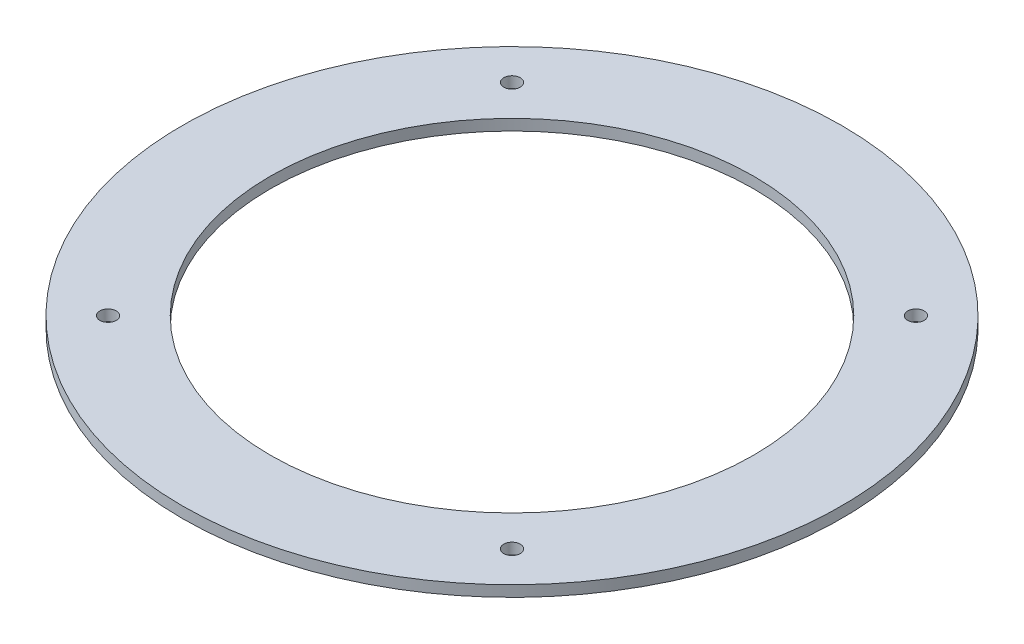
ISO-10303-21;
HEADER;
FILE_DESCRIPTION(('STEP AP214'),'2;1');
FILE_NAME('part.step','',(''),(''),'','','');
FILE_SCHEMA(('AUTOMOTIVE_DESIGN { 1 0 10303 214 1 1 1 1 }'));
ENDSEC;
DATA;
#1=APPLICATION_CONTEXT('core data for automotive mechanical design processes');
#2=APPLICATION_PROTOCOL_DEFINITION('international standard','automotive_design',2000,#1);
#3=PRODUCT_CONTEXT('',#1,'mechanical');
#4=PRODUCT('Part','Part','',(#3));
#5=PRODUCT_RELATED_PRODUCT_CATEGORY('part','',(#4));
#6=PRODUCT_DEFINITION_FORMATION('','',#4);
#7=PRODUCT_DEFINITION_CONTEXT('part definition',#1,'design');
#8=PRODUCT_DEFINITION('design','',#6,#7);
#9=PRODUCT_DEFINITION_SHAPE('','',#8);
#10=(LENGTH_UNIT() NAMED_UNIT(*) SI_UNIT(.MILLI.,.METRE.));
#11=(NAMED_UNIT(*) PLANE_ANGLE_UNIT() SI_UNIT($,.RADIAN.));
#12=(NAMED_UNIT(*) SI_UNIT($,.STERADIAN.) SOLID_ANGLE_UNIT());
#13=UNCERTAINTY_MEASURE_WITH_UNIT(LENGTH_MEASURE(1.E-05),#10,'distance_accuracy_value','');
#14=(GEOMETRIC_REPRESENTATION_CONTEXT(3) GLOBAL_UNCERTAINTY_ASSIGNED_CONTEXT((#13)) GLOBAL_UNIT_ASSIGNED_CONTEXT((#10,
#11,#12)) REPRESENTATION_CONTEXT('',''));
#15=CARTESIAN_POINT('',(0.,0.,0.));
#16=DIRECTION('',(0.,0.,1.));
#17=DIRECTION('',(1.,0.,0.));
#18=AXIS2_PLACEMENT_3D('',#15,#16,#17);
#19=CARTESIAN_POINT('',(0.,-2.,0.));
#20=DIRECTION('',(0.,1.,0.));
#21=DIRECTION('',(0.,0.,1.));
#22=AXIS2_PLACEMENT_3D('',#19,#20,#21);
#23=CYLINDRICAL_SURFACE('',#22,60.);
#24=CARTESIAN_POINT('',(0.,-2.,0.));
#25=DIRECTION('',(0.,1.,0.));
#26=DIRECTION('',(0.,0.,1.));
#27=AXIS2_PLACEMENT_3D('',#24,#25,#26);
#28=CIRCLE('',#27,60.);
#29=CARTESIAN_POINT('',(0.,-2.,60.));
#30=VERTEX_POINT('',#29);
#31=EDGE_CURVE('E10',#30,#30,#28,.T.);
#32=ORIENTED_EDGE('',*,*,#31,.T.);
#33=EDGE_LOOP('',(#32));
#34=FACE_BOUND('',#33,.T.);
#35=CARTESIAN_POINT('',(0.,0.,0.));
#36=DIRECTION('',(0.,1.,0.));
#37=DIRECTION('',(0.,0.,1.));
#38=AXIS2_PLACEMENT_3D('',#35,#36,#37);
#39=CIRCLE('',#38,60.);
#40=CARTESIAN_POINT('',(0.,0.,60.));
#41=VERTEX_POINT('',#40);
#42=EDGE_CURVE('E40',#41,#41,#39,.T.);
#43=ORIENTED_EDGE('',*,*,#42,.F.);
#44=EDGE_LOOP('',(#43));
#45=FACE_BOUND('',#44,.T.);
#46=ADVANCED_FACE('F37',(#34,#45),#23,.T.);
#47=CARTESIAN_POINT('',(0.,-2.,0.));
#48=DIRECTION('',(0.,1.,0.));
#49=DIRECTION('',(0.,0.,1.));
#50=AXIS2_PLACEMENT_3D('',#47,#48,#49);
#51=PLANE('',#50);
#52=CARTESIAN_POINT('',(36.7695526217005,-2.,-36.7695526217005));
#53=DIRECTION('',(0.,1.,0.));
#54=DIRECTION('',(0.,0.,1.));
#55=AXIS2_PLACEMENT_3D('',#52,#53,#54);
#56=CIRCLE('',#55,1.5);
#57=CARTESIAN_POINT('',(36.7695526217005,-2.,-35.2695526217005));
#58=VERTEX_POINT('',#57);
#59=EDGE_CURVE('E60',#58,#58,#56,.F.);
#60=ORIENTED_EDGE('',*,*,#59,.F.);
#61=EDGE_LOOP('',(#60));
#62=FACE_BOUND('',#61,.T.);
#63=CARTESIAN_POINT('',(-36.7695526217005,-2.,36.7695526217005));
#64=DIRECTION('',(0.,1.,0.));
#65=DIRECTION('',(0.,0.,1.));
#66=AXIS2_PLACEMENT_3D('',#63,#64,#65);
#67=CIRCLE('',#66,1.5);
#68=CARTESIAN_POINT('',(-36.7695526217005,-2.,38.2695526217005));
#69=VERTEX_POINT('',#68);
#70=EDGE_CURVE('E61',#69,#69,#67,.F.);
#71=ORIENTED_EDGE('',*,*,#70,.F.);
#72=EDGE_LOOP('',(#71));
#73=FACE_BOUND('',#72,.T.);
#74=CARTESIAN_POINT('',(36.7695526217005,-2.,36.7695526217005));
#75=DIRECTION('',(0.,1.,0.));
#76=DIRECTION('',(0.,0.,1.));
#77=AXIS2_PLACEMENT_3D('',#74,#75,#76);
#78=CIRCLE('',#77,1.5);
#79=CARTESIAN_POINT('',(36.7695526217005,-2.,38.2695526217005));
#80=VERTEX_POINT('',#79);
#81=EDGE_CURVE('E68',#80,#80,#78,.F.);
#82=ORIENTED_EDGE('',*,*,#81,.F.);
#83=EDGE_LOOP('',(#82));
#84=FACE_BOUND('',#83,.T.);
#85=CARTESIAN_POINT('',(-36.7695526217005,-2.,-36.7695526217005));
#86=DIRECTION('',(0.,1.,0.));
#87=DIRECTION('',(0.,0.,1.));
#88=AXIS2_PLACEMENT_3D('',#85,#86,#87);
#89=CIRCLE('',#88,1.5);
#90=CARTESIAN_POINT('',(-36.7695526217005,-2.,-35.2695526217005));
#91=VERTEX_POINT('',#90);
#92=EDGE_CURVE('E54',#91,#91,#89,.F.);
#93=ORIENTED_EDGE('',*,*,#92,.F.);
#94=EDGE_LOOP('',(#93));
#95=FACE_BOUND('',#94,.T.);
#96=CARTESIAN_POINT('',(0.,-2.,0.));
#97=DIRECTION('',(0.,1.,0.));
#98=DIRECTION('',(0.,0.,1.));
#99=AXIS2_PLACEMENT_3D('',#96,#97,#98);
#100=CIRCLE('',#99,44.);
#101=CARTESIAN_POINT('',(0.,-2.,44.));
#102=VERTEX_POINT('',#101);
#103=EDGE_CURVE('E47',#102,#102,#100,.F.);
#104=ORIENTED_EDGE('',*,*,#103,.F.);
#105=EDGE_LOOP('',(#104));
#106=FACE_BOUND('',#105,.T.);
#107=ORIENTED_EDGE('',*,*,#31,.F.);
#108=EDGE_LOOP('',(#107));
#109=FACE_BOUND('',#108,.T.);
#110=ADVANCED_FACE('F86',(#62,#73,#84,#95,#106,#109),#51,.F.);
#111=CARTESIAN_POINT('',(0.,0.,0.));
#112=DIRECTION('',(0.,1.,0.));
#113=DIRECTION('',(0.,0.,1.));
#114=AXIS2_PLACEMENT_3D('',#111,#112,#113);
#115=PLANE('',#114);
#116=CARTESIAN_POINT('',(36.7695526217005,0.,-36.7695526217005));
#117=DIRECTION('',(0.,1.,0.));
#118=DIRECTION('',(0.,0.,-1.));
#119=AXIS2_PLACEMENT_3D('',#116,#117,#118);
#120=CIRCLE('',#119,1.5);
#121=CARTESIAN_POINT('',(36.7695526217005,0.,-38.2695526217005));
#122=VERTEX_POINT('',#121);
#123=EDGE_CURVE('E64',#122,#122,#120,.T.);
#124=ORIENTED_EDGE('',*,*,#123,.F.);
#125=EDGE_LOOP('',(#124));
#126=FACE_BOUND('',#125,.T.);
#127=CARTESIAN_POINT('',(-36.7695526217005,0.,36.7695526217005));
#128=DIRECTION('',(0.,1.,0.));
#129=DIRECTION('',(0.,0.,-1.));
#130=AXIS2_PLACEMENT_3D('',#127,#128,#129);
#131=CIRCLE('',#130,1.5);
#132=CARTESIAN_POINT('',(-36.7695526217005,0.,35.2695526217005));
#133=VERTEX_POINT('',#132);
#134=EDGE_CURVE('E65',#133,#133,#131,.T.);
#135=ORIENTED_EDGE('',*,*,#134,.F.);
#136=EDGE_LOOP('',(#135));
#137=FACE_BOUND('',#136,.T.);
#138=CARTESIAN_POINT('',(36.7695526217005,0.,36.7695526217005));
#139=DIRECTION('',(0.,1.,0.));
#140=DIRECTION('',(0.,0.,-1.));
#141=AXIS2_PLACEMENT_3D('',#138,#139,#140);
#142=CIRCLE('',#141,1.5);
#143=CARTESIAN_POINT('',(36.7695526217005,0.,35.2695526217005));
#144=VERTEX_POINT('',#143);
#145=EDGE_CURVE('E75',#144,#144,#142,.T.);
#146=ORIENTED_EDGE('',*,*,#145,.F.);
#147=EDGE_LOOP('',(#146));
#148=FACE_BOUND('',#147,.T.);
#149=CARTESIAN_POINT('',(-36.7695526217005,0.,-36.7695526217005));
#150=DIRECTION('',(0.,1.,0.));
#151=DIRECTION('',(0.,0.,-1.));
#152=AXIS2_PLACEMENT_3D('',#149,#150,#151);
#153=CIRCLE('',#152,1.5);
#154=CARTESIAN_POINT('',(-36.7695526217005,0.,-38.2695526217005));
#155=VERTEX_POINT('',#154);
#156=EDGE_CURVE('E57',#155,#155,#153,.T.);
#157=ORIENTED_EDGE('',*,*,#156,.F.);
#158=EDGE_LOOP('',(#157));
#159=FACE_BOUND('',#158,.T.);
#160=CARTESIAN_POINT('',(0.,0.,0.));
#161=DIRECTION('',(0.,1.,0.));
#162=DIRECTION('',(0.,0.,1.));
#163=AXIS2_PLACEMENT_3D('',#160,#161,#162);
#164=CIRCLE('',#163,44.);
#165=CARTESIAN_POINT('',(0.,0.,44.));
#166=VERTEX_POINT('',#165);
#167=EDGE_CURVE('E51',#166,#166,#164,.T.);
#168=ORIENTED_EDGE('',*,*,#167,.F.);
#169=EDGE_LOOP('',(#168));
#170=FACE_BOUND('',#169,.T.);
#171=ORIENTED_EDGE('',*,*,#42,.T.);
#172=EDGE_LOOP('',(#171));
#173=FACE_BOUND('',#172,.T.);
#174=ADVANCED_FACE('F82',(#126,#137,#148,#159,#170,#173),#115,.T.);
#175=CARTESIAN_POINT('',(0.,-2.001,0.));
#176=DIRECTION('',(0.,1.,0.));
#177=DIRECTION('',(0.,0.,1.));
#178=AXIS2_PLACEMENT_3D('',#175,#176,#177);
#179=CYLINDRICAL_SURFACE('',#178,44.);
#180=ORIENTED_EDGE('',*,*,#167,.T.);
#181=EDGE_LOOP('',(#180));
#182=FACE_BOUND('',#181,.T.);
#183=ORIENTED_EDGE('',*,*,#103,.T.);
#184=EDGE_LOOP('',(#183));
#185=FACE_BOUND('',#184,.T.);
#186=ADVANCED_FACE('F85',(#182,#185),#179,.F.);
#187=CARTESIAN_POINT('',(-36.7695526217005,-2.001,-36.7695526217005));
#188=DIRECTION('',(0.,1.,0.));
#189=DIRECTION('',(0.,0.,1.));
#190=AXIS2_PLACEMENT_3D('',#187,#188,#189);
#191=CYLINDRICAL_SURFACE('',#190,1.5);
#192=ORIENTED_EDGE('',*,*,#156,.T.);
#193=EDGE_LOOP('',(#192));
#194=FACE_BOUND('',#193,.T.);
#195=ORIENTED_EDGE('',*,*,#92,.T.);
#196=EDGE_LOOP('',(#195));
#197=FACE_BOUND('',#196,.T.);
#198=ADVANCED_FACE('F107',(#194,#197),#191,.F.);
#199=CARTESIAN_POINT('',(36.7695526217005,-2.001,36.7695526217005));
#200=DIRECTION('',(0.,1.,0.));
#201=DIRECTION('',(0.,0.,1.));
#202=AXIS2_PLACEMENT_3D('',#199,#200,#201);
#203=CYLINDRICAL_SURFACE('',#202,1.5);
#204=ORIENTED_EDGE('',*,*,#145,.T.);
#205=EDGE_LOOP('',(#204));
#206=FACE_BOUND('',#205,.T.);
#207=ORIENTED_EDGE('',*,*,#81,.T.);
#208=EDGE_LOOP('',(#207));
#209=FACE_BOUND('',#208,.T.);
#210=ADVANCED_FACE('F79',(#206,#209),#203,.F.);
#211=CARTESIAN_POINT('',(-36.7695526217005,-2.001,36.7695526217005));
#212=DIRECTION('',(0.,1.,0.));
#213=DIRECTION('',(0.,0.,1.));
#214=AXIS2_PLACEMENT_3D('',#211,#212,#213);
#215=CYLINDRICAL_SURFACE('',#214,1.5);
#216=ORIENTED_EDGE('',*,*,#134,.T.);
#217=EDGE_LOOP('',(#216));
#218=FACE_BOUND('',#217,.T.);
#219=ORIENTED_EDGE('',*,*,#70,.T.);
#220=EDGE_LOOP('',(#219));
#221=FACE_BOUND('',#220,.T.);
#222=ADVANCED_FACE('F112',(#218,#221),#215,.F.);
#223=CARTESIAN_POINT('',(36.7695526217005,-2.001,-36.7695526217005));
#224=DIRECTION('',(0.,1.,0.));
#225=DIRECTION('',(0.,0.,1.));
#226=AXIS2_PLACEMENT_3D('',#223,#224,#225);
#227=CYLINDRICAL_SURFACE('',#226,1.5);
#228=ORIENTED_EDGE('',*,*,#123,.T.);
#229=EDGE_LOOP('',(#228));
#230=FACE_BOUND('',#229,.T.);
#231=ORIENTED_EDGE('',*,*,#59,.T.);
#232=EDGE_LOOP('',(#231));
#233=FACE_BOUND('',#232,.T.);
#234=ADVANCED_FACE('F115',(#230,#233),#227,.F.);
#235=CLOSED_SHELL('',(#46,#110,#174,#186,#198,#210,#222,#234));
#236=MANIFOLD_SOLID_BREP('B2',#235);
#237=ADVANCED_BREP_SHAPE_REPRESENTATION('',(#18,#236),#14);
#238=SHAPE_DEFINITION_REPRESENTATION(#9,#237);
ENDSEC;
END-ISO-10303-21;
